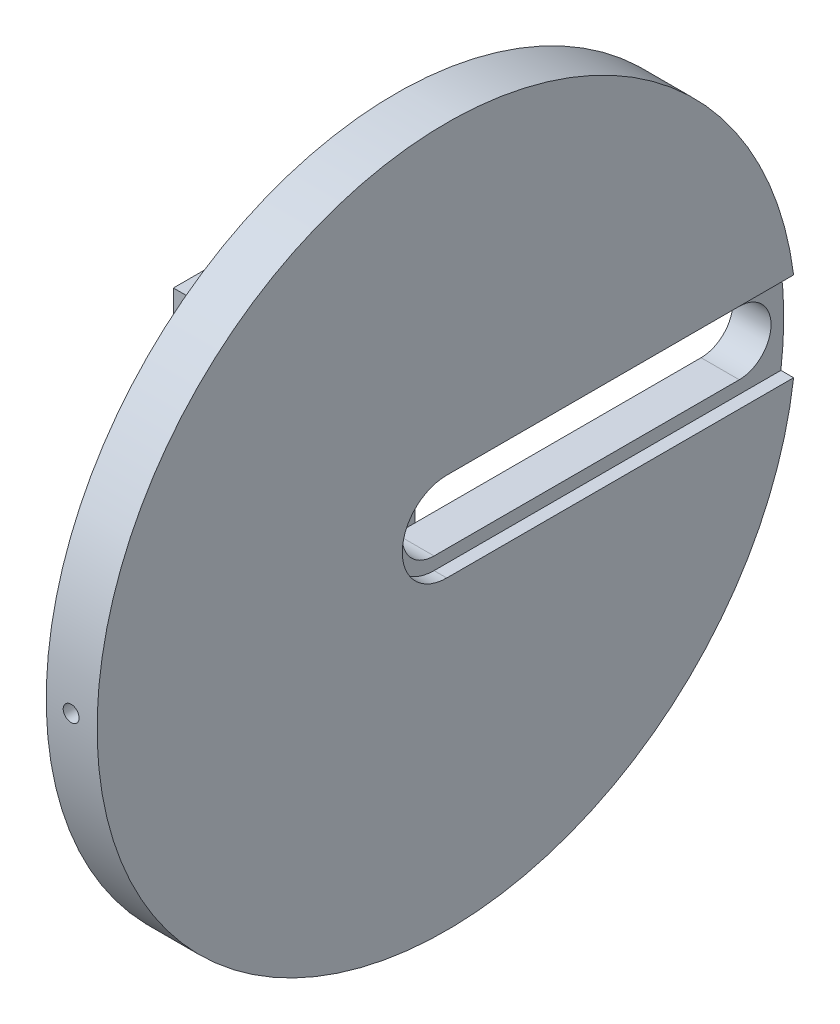
ISO-10303-21;
HEADER;
FILE_DESCRIPTION(('STEP AP214'),'2;1');
FILE_NAME('part.step','',(''),(''),'','','');
FILE_SCHEMA(('AUTOMOTIVE_DESIGN { 1 0 10303 214 1 1 1 1 }'));
ENDSEC;
DATA;
#1=APPLICATION_CONTEXT('core data for automotive mechanical design processes');
#2=APPLICATION_PROTOCOL_DEFINITION('international standard','automotive_design',2000,#1);
#3=PRODUCT_CONTEXT('',#1,'mechanical');
#4=PRODUCT('Part','Part','',(#3));
#5=PRODUCT_RELATED_PRODUCT_CATEGORY('part','',(#4));
#6=PRODUCT_DEFINITION_FORMATION('','',#4);
#7=PRODUCT_DEFINITION_CONTEXT('part definition',#1,'design');
#8=PRODUCT_DEFINITION('design','',#6,#7);
#9=PRODUCT_DEFINITION_SHAPE('','',#8);
#10=(LENGTH_UNIT() NAMED_UNIT(*) SI_UNIT(.MILLI.,.METRE.));
#11=(NAMED_UNIT(*) PLANE_ANGLE_UNIT() SI_UNIT($,.RADIAN.));
#12=(NAMED_UNIT(*) SI_UNIT($,.STERADIAN.) SOLID_ANGLE_UNIT());
#13=UNCERTAINTY_MEASURE_WITH_UNIT(LENGTH_MEASURE(1.E-05),#10,'distance_accuracy_value','');
#14=(GEOMETRIC_REPRESENTATION_CONTEXT(3) GLOBAL_UNCERTAINTY_ASSIGNED_CONTEXT((#13)) GLOBAL_UNIT_ASSIGNED_CONTEXT((#10,
#11,#12)) REPRESENTATION_CONTEXT('',''));
#15=CARTESIAN_POINT('',(0.,0.,0.));
#16=DIRECTION('',(0.,0.,1.));
#17=DIRECTION('',(1.,0.,0.));
#18=AXIS2_PLACEMENT_3D('',#15,#16,#17);
#19=CARTESIAN_POINT('',(-0.001000000000001,0.,0.));
#20=DIRECTION('',(1.,0.,0.));
#21=DIRECTION('',(0.,0.,-1.));
#22=AXIS2_PLACEMENT_3D('',#19,#20,#21);
#23=CYLINDRICAL_SURFACE('',#22,5.);
#24=CARTESIAN_POINT('',(36.,0.,0.));
#25=DIRECTION('',(1.,0.,0.));
#26=DIRECTION('',(0.,0.,-1.));
#27=AXIS2_PLACEMENT_3D('',#24,#25,#26);
#28=CIRCLE('',#27,5.);
#29=CARTESIAN_POINT('',(36.,-5.,0.));
#30=VERTEX_POINT('',#29);
#31=CARTESIAN_POINT('',(36.,5.,0.));
#32=VERTEX_POINT('',#31);
#33=EDGE_CURVE('E204',#30,#32,#28,.F.);
#34=ORIENTED_EDGE('',*,*,#33,.F.);
#35=DIRECTION('',(1.,0.,0.));
#36=VECTOR('',#35,1.);
#37=CARTESIAN_POINT('',(-0.001000000000001,-5.,0.));
#38=LINE('',#37,#36);
#39=CARTESIAN_POINT('',(30.,-5.,0.));
#40=VERTEX_POINT('',#39);
#41=EDGE_CURVE('E214',#40,#30,#38,.T.);
#42=ORIENTED_EDGE('',*,*,#41,.F.);
#43=CARTESIAN_POINT('',(30.,0.,0.));
#44=DIRECTION('',(1.,0.,0.));
#45=DIRECTION('',(0.,0.,-1.));
#46=AXIS2_PLACEMENT_3D('',#43,#44,#45);
#47=CIRCLE('',#46,5.);
#48=CARTESIAN_POINT('',(30.,5.,0.));
#49=VERTEX_POINT('',#48);
#50=EDGE_CURVE('E211',#40,#49,#47,.F.);
#51=ORIENTED_EDGE('',*,*,#50,.T.);
#52=DIRECTION('',(1.,0.,0.));
#53=VECTOR('',#52,1.);
#54=CARTESIAN_POINT('',(-0.001000000000001,5.,0.));
#55=LINE('',#54,#53);
#56=EDGE_CURVE('E215',#49,#32,#55,.T.);
#57=ORIENTED_EDGE('',*,*,#56,.T.);
#58=EDGE_LOOP('',(#34,#42,#51,#57));
#59=FACE_BOUND('',#58,.T.);
#60=ADVANCED_FACE('F39',(#59),#23,.F.);
#61=CARTESIAN_POINT('',(-0.001000000000001,5.,0.));
#62=DIRECTION('',(0.,-1.,0.));
#63=DIRECTION('',(0.,0.,-1.));
#64=AXIS2_PLACEMENT_3D('',#61,#62,#63);
#65=PLANE('',#64);
#66=DIRECTION('',(1.,0.,0.));
#67=VECTOR('',#66,1.);
#68=CARTESIAN_POINT('',(-0.001000000000001,5.,-48.));
#69=LINE('',#68,#67);
#70=CARTESIAN_POINT('',(30.,5.,-48.));
#71=VERTEX_POINT('',#70);
#72=CARTESIAN_POINT('',(36.,5.,-48.));
#73=VERTEX_POINT('',#72);
#74=EDGE_CURVE('E219',#71,#73,#69,.T.);
#75=ORIENTED_EDGE('',*,*,#74,.T.);
#76=DIRECTION('',(0.,0.,1.));
#77=VECTOR('',#76,1.);
#78=CARTESIAN_POINT('',(36.,5.,0.));
#79=LINE('',#78,#77);
#80=EDGE_CURVE('E201',#73,#32,#79,.T.);
#81=ORIENTED_EDGE('',*,*,#80,.T.);
#82=ORIENTED_EDGE('',*,*,#56,.F.);
#83=DIRECTION('',(0.,0.,1.));
#84=VECTOR('',#83,1.);
#85=CARTESIAN_POINT('',(30.,5.,0.));
#86=LINE('',#85,#84);
#87=EDGE_CURVE('E208',#71,#49,#86,.T.);
#88=ORIENTED_EDGE('',*,*,#87,.F.);
#89=EDGE_LOOP('',(#75,#81,#82,#88));
#90=FACE_BOUND('',#89,.T.);
#91=ADVANCED_FACE('F354',(#90),#65,.T.);
#92=CARTESIAN_POINT('',(-0.001000000000001,0.,-48.));
#93=DIRECTION('',(1.,0.,0.));
#94=DIRECTION('',(0.,0.,-1.));
#95=AXIS2_PLACEMENT_3D('',#92,#93,#94);
#96=CYLINDRICAL_SURFACE('',#95,5.);
#97=CARTESIAN_POINT('',(36.,0.,-48.));
#98=DIRECTION('',(1.,0.,0.));
#99=DIRECTION('',(0.,0.,-1.));
#100=AXIS2_PLACEMENT_3D('',#97,#98,#99);
#101=CIRCLE('',#100,5.);
#102=CARTESIAN_POINT('',(36.,-5.,-48.));
#103=VERTEX_POINT('',#102);
#104=EDGE_CURVE('E66',#73,#103,#101,.F.);
#105=ORIENTED_EDGE('',*,*,#104,.F.);
#106=ORIENTED_EDGE('',*,*,#74,.F.);
#107=CARTESIAN_POINT('',(30.,0.,-48.));
#108=DIRECTION('',(1.,0.,0.));
#109=DIRECTION('',(0.,0.,-1.));
#110=AXIS2_PLACEMENT_3D('',#107,#108,#109);
#111=CIRCLE('',#110,5.);
#112=CARTESIAN_POINT('',(30.,-5.,-48.));
#113=VERTEX_POINT('',#112);
#114=EDGE_CURVE('E206',#71,#113,#111,.F.);
#115=ORIENTED_EDGE('',*,*,#114,.T.);
#116=DIRECTION('',(1.,0.,0.));
#117=VECTOR('',#116,1.);
#118=CARTESIAN_POINT('',(-0.001000000000001,-5.,-48.));
#119=LINE('',#118,#117);
#120=EDGE_CURVE('E222',#113,#103,#119,.T.);
#121=ORIENTED_EDGE('',*,*,#120,.T.);
#122=EDGE_LOOP('',(#105,#106,#115,#121));
#123=FACE_BOUND('',#122,.T.);
#124=ADVANCED_FACE('F360',(#123),#96,.F.);
#125=CARTESIAN_POINT('',(-0.001000000000001,-5.,0.));
#126=DIRECTION('',(0.,-1.,0.));
#127=DIRECTION('',(0.,0.,-1.));
#128=AXIS2_PLACEMENT_3D('',#125,#126,#127);
#129=PLANE('',#128);
#130=DIRECTION('',(0.,0.,1.));
#131=VECTOR('',#130,1.);
#132=CARTESIAN_POINT('',(36.,-5.,0.));
#133=LINE('',#132,#131);
#134=EDGE_CURVE('E51',#103,#30,#133,.T.);
#135=ORIENTED_EDGE('',*,*,#134,.F.);
#136=ORIENTED_EDGE('',*,*,#120,.F.);
#137=DIRECTION('',(0.,0.,1.));
#138=VECTOR('',#137,1.);
#139=CARTESIAN_POINT('',(30.,-5.,0.));
#140=LINE('',#139,#138);
#141=EDGE_CURVE('E218',#113,#40,#140,.T.);
#142=ORIENTED_EDGE('',*,*,#141,.T.);
#143=ORIENTED_EDGE('',*,*,#41,.T.);
#144=EDGE_LOOP('',(#135,#136,#142,#143));
#145=FACE_BOUND('',#144,.T.);
#146=ADVANCED_FACE('F365',(#145),#129,.F.);
#147=CARTESIAN_POINT('',(18.,0.,0.));
#148=DIRECTION('',(-1.,0.,0.));
#149=DIRECTION('',(0.,0.,1.));
#150=AXIS2_PLACEMENT_3D('',#147,#148,#149);
#151=PLANE('',#150);
#152=CARTESIAN_POINT('',(18.,0.,0.));
#153=DIRECTION('',(-1.,0.,0.));
#154=DIRECTION('',(0.,0.,1.));
#155=AXIS2_PLACEMENT_3D('',#152,#153,#154);
#156=CIRCLE('',#155,9.);
#157=CARTESIAN_POINT('',(18.,0.,9.));
#158=VERTEX_POINT('',#157);
#159=EDGE_CURVE('E169',#158,#158,#156,.F.);
#160=ORIENTED_EDGE('',*,*,#159,.F.);
#161=EDGE_LOOP('',(#160));
#162=FACE_BOUND('',#161,.T.);
#163=DIRECTION('',(0.,0.,1.));
#164=VECTOR('',#163,1.);
#165=CARTESIAN_POINT('',(18.,-18.,15.));
#166=LINE('',#165,#164);
#167=CARTESIAN_POINT('',(18.,-18.,-15.));
#168=VERTEX_POINT('',#167);
#169=CARTESIAN_POINT('',(18.,-18.,15.));
#170=VERTEX_POINT('',#169);
#171=EDGE_CURVE('E233',#168,#170,#166,.T.);
#172=ORIENTED_EDGE('',*,*,#171,.F.);
#173=DIRECTION('',(0.,1.,0.));
#174=VECTOR('',#173,1.);
#175=CARTESIAN_POINT('',(18.,-26.,-15.));
#176=LINE('',#175,#174);
#177=CARTESIAN_POINT('',(18.,18.,-15.));
#178=VERTEX_POINT('',#177);
#179=EDGE_CURVE('E290',#168,#178,#176,.T.);
#180=ORIENTED_EDGE('',*,*,#179,.T.);
#181=DIRECTION('',(0.,0.,-1.));
#182=VECTOR('',#181,1.);
#183=CARTESIAN_POINT('',(18.,18.,15.));
#184=LINE('',#183,#182);
#185=CARTESIAN_POINT('',(18.,18.,15.));
#186=VERTEX_POINT('',#185);
#187=EDGE_CURVE('E256',#186,#178,#184,.T.);
#188=ORIENTED_EDGE('',*,*,#187,.F.);
#189=DIRECTION('',(0.,-1.,0.));
#190=VECTOR('',#189,1.);
#191=CARTESIAN_POINT('',(18.,-26.,15.));
#192=LINE('',#191,#190);
#193=EDGE_CURVE('E278',#186,#170,#192,.T.);
#194=ORIENTED_EDGE('',*,*,#193,.T.);
#195=EDGE_LOOP('',(#172,#180,#188,#194));
#196=FACE_BOUND('',#195,.T.);
#197=ADVANCED_FACE('F334',(#162,#196),#151,.F.);
#198=CARTESIAN_POINT('',(10.,0.,0.));
#199=DIRECTION('',(-1.,0.,0.));
#200=DIRECTION('',(0.,0.,1.));
#201=AXIS2_PLACEMENT_3D('',#198,#199,#200);
#202=PLANE('',#201);
#203=CARTESIAN_POINT('',(10.,0.,0.));
#204=DIRECTION('',(-1.,0.,0.));
#205=DIRECTION('',(0.,0.,1.));
#206=AXIS2_PLACEMENT_3D('',#203,#204,#205);
#207=CIRCLE('',#206,9.);
#208=CARTESIAN_POINT('',(10.,0.,9.));
#209=VERTEX_POINT('',#208);
#210=EDGE_CURVE('E166',#209,#209,#207,.F.);
#211=ORIENTED_EDGE('',*,*,#210,.T.);
#212=EDGE_LOOP('',(#211));
#213=FACE_BOUND('',#212,.T.);
#214=DIRECTION('',(0.,1.,0.));
#215=VECTOR('',#214,1.);
#216=CARTESIAN_POINT('',(10.,-26.,-15.));
#217=LINE('',#216,#215);
#218=CARTESIAN_POINT('',(10.,-26.,-15.));
#219=VERTEX_POINT('',#218);
#220=CARTESIAN_POINT('',(10.,26.,-15.));
#221=VERTEX_POINT('',#220);
#222=EDGE_CURVE('E287',#219,#221,#217,.T.);
#223=ORIENTED_EDGE('',*,*,#222,.F.);
#224=DIRECTION('',(0.,0.,-1.));
#225=VECTOR('',#224,1.);
#226=CARTESIAN_POINT('',(10.,-26.,15.));
#227=LINE('',#226,#225);
#228=CARTESIAN_POINT('',(10.,-26.,15.));
#229=VERTEX_POINT('',#228);
#230=EDGE_CURVE('E291',#229,#219,#227,.T.);
#231=ORIENTED_EDGE('',*,*,#230,.F.);
#232=DIRECTION('',(0.,-1.,0.));
#233=VECTOR('',#232,1.);
#234=CARTESIAN_POINT('',(10.,-26.,15.));
#235=LINE('',#234,#233);
#236=CARTESIAN_POINT('',(10.,26.,15.));
#237=VERTEX_POINT('',#236);
#238=EDGE_CURVE('E309',#237,#229,#235,.T.);
#239=ORIENTED_EDGE('',*,*,#238,.F.);
#240=DIRECTION('',(0.,0.,1.));
#241=VECTOR('',#240,1.);
#242=CARTESIAN_POINT('',(10.,26.,15.));
#243=LINE('',#242,#241);
#244=EDGE_CURVE('E311',#221,#237,#243,.T.);
#245=ORIENTED_EDGE('',*,*,#244,.F.);
#246=EDGE_LOOP('',(#223,#231,#239,#245));
#247=FACE_BOUND('',#246,.T.);
#248=ADVANCED_FACE('F319',(#213,#247),#202,.T.);
#249=CARTESIAN_POINT('',(18.,-26.,-15.));
#250=DIRECTION('',(0.,0.,1.));
#251=DIRECTION('',(1.,0.,0.));
#252=AXIS2_PLACEMENT_3D('',#249,#250,#251);
#253=PLANE('',#252);
#254=ORIENTED_EDGE('',*,*,#222,.T.);
#255=DIRECTION('',(-1.,0.,0.));
#256=VECTOR('',#255,1.);
#257=CARTESIAN_POINT('',(18.,26.,-15.));
#258=LINE('',#257,#256);
#259=CARTESIAN_POINT('',(30.,26.,-15.));
#260=VERTEX_POINT('',#259);
#261=EDGE_CURVE('E292',#260,#221,#258,.T.);
#262=ORIENTED_EDGE('',*,*,#261,.F.);
#263=DIRECTION('',(0.,1.,0.));
#264=VECTOR('',#263,1.);
#265=CARTESIAN_POINT('',(30.,26.,-15.));
#266=LINE('',#265,#264);
#267=CARTESIAN_POINT('',(30.,18.,-15.));
#268=VERTEX_POINT('',#267);
#269=EDGE_CURVE('E263',#268,#260,#266,.T.);
#270=ORIENTED_EDGE('',*,*,#269,.F.);
#271=DIRECTION('',(-1.,0.,0.));
#272=VECTOR('',#271,1.);
#273=CARTESIAN_POINT('',(30.,18.,-15.));
#274=LINE('',#273,#272);
#275=EDGE_CURVE('E269',#268,#178,#274,.T.);
#276=ORIENTED_EDGE('',*,*,#275,.T.);
#277=ORIENTED_EDGE('',*,*,#179,.F.);
#278=DIRECTION('',(-1.,0.,0.));
#279=VECTOR('',#278,1.);
#280=CARTESIAN_POINT('',(30.,-18.,-15.));
#281=LINE('',#280,#279);
#282=CARTESIAN_POINT('',(30.,-18.,-15.));
#283=VERTEX_POINT('',#282);
#284=EDGE_CURVE('E253',#283,#168,#281,.T.);
#285=ORIENTED_EDGE('',*,*,#284,.F.);
#286=DIRECTION('',(0.,1.,0.));
#287=VECTOR('',#286,1.);
#288=CARTESIAN_POINT('',(30.,-26.,-15.));
#289=LINE('',#288,#287);
#290=CARTESIAN_POINT('',(30.,-26.,-15.));
#291=VERTEX_POINT('',#290);
#292=EDGE_CURVE('E242',#291,#283,#289,.T.);
#293=ORIENTED_EDGE('',*,*,#292,.F.);
#294=DIRECTION('',(-1.,0.,0.));
#295=VECTOR('',#294,1.);
#296=CARTESIAN_POINT('',(18.,-26.,-15.));
#297=LINE('',#296,#295);
#298=EDGE_CURVE('E305',#291,#219,#297,.T.);
#299=ORIENTED_EDGE('',*,*,#298,.T.);
#300=EDGE_LOOP('',(#254,#262,#270,#276,#277,#285,#293,#299));
#301=FACE_BOUND('',#300,.T.);
#302=ADVANCED_FACE('F41',(#301),#253,.F.);
#303=CARTESIAN_POINT('',(18.,26.,15.));
#304=DIRECTION('',(0.,-1.,0.));
#305=DIRECTION('',(0.,0.,-1.));
#306=AXIS2_PLACEMENT_3D('',#303,#304,#305);
#307=PLANE('',#306);
#308=ORIENTED_EDGE('',*,*,#244,.T.);
#309=DIRECTION('',(-1.,0.,0.));
#310=VECTOR('',#309,1.);
#311=CARTESIAN_POINT('',(18.,26.,15.));
#312=LINE('',#311,#310);
#313=CARTESIAN_POINT('',(30.,26.,15.));
#314=VERTEX_POINT('',#313);
#315=EDGE_CURVE('E295',#314,#237,#312,.T.);
#316=ORIENTED_EDGE('',*,*,#315,.F.);
#317=DIRECTION('',(0.,0.,1.));
#318=VECTOR('',#317,1.);
#319=CARTESIAN_POINT('',(30.,26.,15.));
#320=LINE('',#319,#318);
#321=EDGE_CURVE('E266',#260,#314,#320,.T.);
#322=ORIENTED_EDGE('',*,*,#321,.F.);
#323=ORIENTED_EDGE('',*,*,#261,.T.);
#324=EDGE_LOOP('',(#308,#316,#322,#323));
#325=FACE_BOUND('',#324,.T.);
#326=ADVANCED_FACE('F321',(#325),#307,.F.);
#327=CARTESIAN_POINT('',(18.,-26.,15.));
#328=DIRECTION('',(0.,0.,-1.));
#329=DIRECTION('',(-1.,0.,0.));
#330=AXIS2_PLACEMENT_3D('',#327,#328,#329);
#331=PLANE('',#330);
#332=ORIENTED_EDGE('',*,*,#238,.T.);
#333=DIRECTION('',(-1.,0.,0.));
#334=VECTOR('',#333,1.);
#335=CARTESIAN_POINT('',(18.,-26.,15.));
#336=LINE('',#335,#334);
#337=CARTESIAN_POINT('',(30.,-26.,15.));
#338=VERTEX_POINT('',#337);
#339=EDGE_CURVE('E300',#338,#229,#336,.T.);
#340=ORIENTED_EDGE('',*,*,#339,.F.);
#341=DIRECTION('',(0.,-1.,0.));
#342=VECTOR('',#341,1.);
#343=CARTESIAN_POINT('',(30.,-26.,15.));
#344=LINE('',#343,#342);
#345=CARTESIAN_POINT('',(30.,-18.,15.));
#346=VERTEX_POINT('',#345);
#347=EDGE_CURVE('E236',#346,#338,#344,.T.);
#348=ORIENTED_EDGE('',*,*,#347,.F.);
#349=DIRECTION('',(-1.,0.,0.));
#350=VECTOR('',#349,1.);
#351=CARTESIAN_POINT('',(30.,-18.,15.));
#352=LINE('',#351,#350);
#353=EDGE_CURVE('E248',#346,#170,#352,.T.);
#354=ORIENTED_EDGE('',*,*,#353,.T.);
#355=ORIENTED_EDGE('',*,*,#193,.F.);
#356=DIRECTION('',(-1.,0.,0.));
#357=VECTOR('',#356,1.);
#358=CARTESIAN_POINT('',(30.,18.,15.));
#359=LINE('',#358,#357);
#360=CARTESIAN_POINT('',(30.,18.,15.));
#361=VERTEX_POINT('',#360);
#362=EDGE_CURVE('E282',#361,#186,#359,.T.);
#363=ORIENTED_EDGE('',*,*,#362,.F.);
#364=DIRECTION('',(0.,-1.,0.));
#365=VECTOR('',#364,1.);
#366=CARTESIAN_POINT('',(30.,26.,15.));
#367=LINE('',#366,#365);
#368=EDGE_CURVE('E257',#314,#361,#367,.T.);
#369=ORIENTED_EDGE('',*,*,#368,.F.);
#370=ORIENTED_EDGE('',*,*,#315,.T.);
#371=EDGE_LOOP('',(#332,#340,#348,#354,#355,#363,#369,#370));
#372=FACE_BOUND('',#371,.T.);
#373=ADVANCED_FACE('F324',(#372),#331,.F.);
#374=CARTESIAN_POINT('',(18.,-26.,15.));
#375=DIRECTION('',(0.,1.,0.));
#376=DIRECTION('',(0.,0.,1.));
#377=AXIS2_PLACEMENT_3D('',#374,#375,#376);
#378=PLANE('',#377);
#379=ORIENTED_EDGE('',*,*,#230,.T.);
#380=ORIENTED_EDGE('',*,*,#298,.F.);
#381=DIRECTION('',(0.,0.,-1.));
#382=VECTOR('',#381,1.);
#383=CARTESIAN_POINT('',(30.,-26.,15.));
#384=LINE('',#383,#382);
#385=EDGE_CURVE('E239',#338,#291,#384,.T.);
#386=ORIENTED_EDGE('',*,*,#385,.F.);
#387=ORIENTED_EDGE('',*,*,#339,.T.);
#388=EDGE_LOOP('',(#379,#380,#386,#387));
#389=FACE_BOUND('',#388,.T.);
#390=ADVANCED_FACE('F343',(#389),#378,.F.);
#391=CARTESIAN_POINT('',(30.,18.,15.));
#392=DIRECTION('',(0.,1.,0.));
#393=DIRECTION('',(0.,0.,1.));
#394=AXIS2_PLACEMENT_3D('',#391,#392,#393);
#395=PLANE('',#394);
#396=ORIENTED_EDGE('',*,*,#187,.T.);
#397=ORIENTED_EDGE('',*,*,#275,.F.);
#398=DIRECTION('',(0.,0.,-1.));
#399=VECTOR('',#398,1.);
#400=CARTESIAN_POINT('',(30.,18.,15.));
#401=LINE('',#400,#399);
#402=EDGE_CURVE('E260',#361,#268,#401,.T.);
#403=ORIENTED_EDGE('',*,*,#402,.F.);
#404=ORIENTED_EDGE('',*,*,#362,.T.);
#405=EDGE_LOOP('',(#396,#397,#403,#404));
#406=FACE_BOUND('',#405,.T.);
#407=ADVANCED_FACE('F332',(#406),#395,.F.);
#408=CARTESIAN_POINT('',(30.,-18.,15.));
#409=DIRECTION('',(0.,-1.,0.));
#410=DIRECTION('',(0.,0.,-1.));
#411=AXIS2_PLACEMENT_3D('',#408,#409,#410);
#412=PLANE('',#411);
#413=ORIENTED_EDGE('',*,*,#171,.T.);
#414=ORIENTED_EDGE('',*,*,#353,.F.);
#415=DIRECTION('',(0.,0.,1.));
#416=VECTOR('',#415,1.);
#417=CARTESIAN_POINT('',(30.,-18.,15.));
#418=LINE('',#417,#416);
#419=EDGE_CURVE('E245',#283,#346,#418,.T.);
#420=ORIENTED_EDGE('',*,*,#419,.F.);
#421=ORIENTED_EDGE('',*,*,#284,.T.);
#422=EDGE_LOOP('',(#413,#414,#420,#421));
#423=FACE_BOUND('',#422,.T.);
#424=ADVANCED_FACE('F338',(#423),#412,.F.);
#425=CARTESIAN_POINT('',(30.,0.,0.));
#426=DIRECTION('',(1.,0.,0.));
#427=DIRECTION('',(0.,0.,-1.));
#428=AXIS2_PLACEMENT_3D('',#425,#426,#427);
#429=PLANE('',#428);
#430=ORIENTED_EDGE('',*,*,#87,.T.);
#431=ORIENTED_EDGE('',*,*,#50,.F.);
#432=ORIENTED_EDGE('',*,*,#141,.F.);
#433=ORIENTED_EDGE('',*,*,#114,.F.);
#434=EDGE_LOOP('',(#430,#431,#432,#433));
#435=FACE_BOUND('',#434,.T.);
#436=ORIENTED_EDGE('',*,*,#347,.T.);
#437=ORIENTED_EDGE('',*,*,#385,.T.);
#438=ORIENTED_EDGE('',*,*,#292,.T.);
#439=ORIENTED_EDGE('',*,*,#419,.T.);
#440=EDGE_LOOP('',(#436,#437,#438,#439));
#441=FACE_BOUND('',#440,.T.);
#442=CARTESIAN_POINT('',(30.,0.,0.));
#443=DIRECTION('',(1.,0.,0.));
#444=DIRECTION('',(0.,0.,-1.));
#445=AXIS2_PLACEMENT_3D('',#442,#443,#444);
#446=CIRCLE('',#445,55.);
#447=CARTESIAN_POINT('',(30.,0.,-55.));
#448=VERTEX_POINT('',#447);
#449=EDGE_CURVE('E229',#448,#448,#446,.T.);
#450=ORIENTED_EDGE('',*,*,#449,.F.);
#451=EDGE_LOOP('',(#450));
#452=FACE_BOUND('',#451,.T.);
#453=ORIENTED_EDGE('',*,*,#402,.T.);
#454=ORIENTED_EDGE('',*,*,#269,.T.);
#455=ORIENTED_EDGE('',*,*,#321,.T.);
#456=ORIENTED_EDGE('',*,*,#368,.T.);
#457=EDGE_LOOP('',(#453,#454,#455,#456));
#458=FACE_BOUND('',#457,.T.);
#459=ADVANCED_FACE('F328',(#435,#441,#452,#458),#429,.F.);
#460=CARTESIAN_POINT('',(38.,0.,0.));
#461=DIRECTION('',(-1.,0.,0.));
#462=DIRECTION('',(0.,0.,1.));
#463=AXIS2_PLACEMENT_3D('',#460,#461,#462);
#464=CYLINDRICAL_SURFACE('',#463,55.);
#465=CARTESIAN_POINT('',(35.1687185731574,0.,55.));
#466=CARTESIAN_POINT('',(35.1687154629174,-0.0702033225971107,54.9999998083149));
#467=CARTESIAN_POINT('',(35.1627845165973,-0.140457318451282,54.9998641436759));
#468=CARTESIAN_POINT('',(35.1392074714067,-0.279029811415266,54.9993359924255));
#469=CARTESIAN_POINT('',(35.1215473330444,-0.347345886586122,54.9989431980455));
#470=CARTESIAN_POINT('',(35.0750155055497,-0.480014960528598,54.9979452762615));
#471=CARTESIAN_POINT('',(35.0461492458831,-0.544369861057251,54.9973402516985));
#472=CARTESIAN_POINT('',(34.9780322309823,-0.667302220283155,54.9959861402455));
#473=CARTESIAN_POINT('',(34.9387840308411,-0.725881095651578,54.9952370888142));
#474=CARTESIAN_POINT('',(34.8510018233051,-0.83563564240584,54.9936790140363));
#475=CARTESIAN_POINT('',(34.8024653495349,-0.886809341094589,54.9928699747958));
#476=CARTESIAN_POINT('',(34.697488162228,-0.980284479427353,54.9912832504395));
#477=CARTESIAN_POINT('',(34.641047135922,-1.02258556783222,54.990505566566));
#478=CARTESIAN_POINT('',(34.5218580588459,-1.0971159329841,54.9890691986985));
#479=CARTESIAN_POINT('',(34.4591094432909,-1.1293443067511,54.9884105253755));
#480=CARTESIAN_POINT('',(34.3290904760957,-1.18280840216345,54.9872865620097));
#481=CARTESIAN_POINT('',(34.261820138736,-1.20404415852373,54.9868212713564));
#482=CARTESIAN_POINT('',(34.1246795870205,-1.23491674399312,54.9861366306439));
#483=CARTESIAN_POINT('',(34.0548098249757,-1.24455558137512,54.9859172380023));
#484=CARTESIAN_POINT('',(33.9144436059398,-1.25196689341139,54.9857490017193));
#485=CARTESIAN_POINT('',(33.843947150866,-1.24973940435953,54.9858001572504));
#486=CARTESIAN_POINT('',(33.7043423167665,-1.23348302226206,54.9861672088946));
#487=CARTESIAN_POINT('',(33.6352336839087,-1.21945630779407,54.9864830561357));
#488=CARTESIAN_POINT('',(33.5003523387652,-1.18000300635237,54.9873438073805));
#489=CARTESIAN_POINT('',(33.4345796321968,-1.15457639984145,54.9878887117767));
#490=CARTESIAN_POINT('',(33.3082302325844,-1.09304258801365,54.9891462040845));
#491=CARTESIAN_POINT('',(33.2476540263589,-1.05693438342978,54.9898588076831));
#492=CARTESIAN_POINT('',(33.1334225346168,-0.975063117914926,54.9913713461912));
#493=CARTESIAN_POINT('',(33.0797672569849,-0.929300045984877,54.9921712812001));
#494=CARTESIAN_POINT('',(32.9808879965023,-0.829405758170149,54.993768519721));
#495=CARTESIAN_POINT('',(32.9356659246492,-0.775272650673601,54.9945658225964));
#496=CARTESIAN_POINT('',(32.8549514884159,-0.660181625707142,54.996067737825));
#497=CARTESIAN_POINT('',(32.8194591254693,-0.599223707231658,54.9967723501645));
#498=CARTESIAN_POINT('',(32.7592118425164,-0.472212409220082,54.9980094562844));
#499=CARTESIAN_POINT('',(32.7344569808221,-0.406159002014322,54.9985419491299));
#500=CARTESIAN_POINT('',(32.6963886215412,-0.270832239126326,54.9993747714152));
#501=CARTESIAN_POINT('',(32.6830751058633,-0.201558888535736,54.999675101222));
#502=CARTESIAN_POINT('',(32.6682697023611,-0.0617752845858374,55.0000096942994));
#503=CARTESIAN_POINT('',(32.6667751707788,0.0087346886197038,55.0000440170724));
#504=CARTESIAN_POINT('',(32.6756432731366,0.149004573067808,54.9998428843483));
#505=CARTESIAN_POINT('',(32.6860058994228,0.218764484794512,54.9996074290253));
#506=CARTESIAN_POINT('',(32.7182919695658,0.3555466305284,54.9988933186772));
#507=CARTESIAN_POINT('',(32.7402142148637,0.422569147586204,54.9984146888658));
#508=CARTESIAN_POINT('',(32.7949960051069,0.551982636371895,54.9972681756064));
#509=CARTESIAN_POINT('',(32.8278555620766,0.61437360300779,54.9966002919503));
#510=CARTESIAN_POINT('',(32.9035860171131,0.732765094902012,54.9951503865922));
#511=CARTESIAN_POINT('',(32.9464586955816,0.788764481054191,54.9943683446013));
#512=CARTESIAN_POINT('',(33.040995772815,0.892771748529622,54.9927783404182));
#513=CARTESIAN_POINT('',(33.0926601859742,0.940779616768441,54.9919703781835));
#514=CARTESIAN_POINT('',(33.2033254731257,1.02744987003503,54.9904194516864));
#515=CARTESIAN_POINT('',(33.2623276833995,1.06611054906708,54.9896764993051));
#516=CARTESIAN_POINT('',(33.3859868285842,1.13297729831911,54.9883395431988));
#517=CARTESIAN_POINT('',(33.4506437536333,1.16118338677133,54.987745539214));
#518=CARTESIAN_POINT('',(33.5837705054313,1.20633730851337,54.9867735356912));
#519=CARTESIAN_POINT('',(33.6522399559727,1.22328625049517,54.9863955148819));
#520=CARTESIAN_POINT('',(33.791053538087,1.24544840138361,54.9858980377502));
#521=CARTESIAN_POINT('',(33.861397670155,1.25066160719106,54.985778581496));
#522=CARTESIAN_POINT('',(34.0019466025633,1.24920415341509,54.9858117097198));
#523=CARTESIAN_POINT('',(34.0721514309195,1.24253619255843,54.9859642324196));
#524=CARTESIAN_POINT('',(34.2104449584081,1.21751121518807,54.9865239942186));
#525=CARTESIAN_POINT('',(34.2785336533169,1.19915417534568,54.9869312338261));
#526=CARTESIAN_POINT('',(34.4106636179346,1.15127231564921,54.9879545142859));
#527=CARTESIAN_POINT('',(34.4747048155149,1.12174729684142,54.988570558858));
#528=CARTESIAN_POINT('',(34.5969195440842,1.05236905758342,54.9899419701183));
#529=CARTESIAN_POINT('',(34.6550932948987,1.01251622426765,54.9906973315839));
#530=CARTESIAN_POINT('',(34.7639329116408,0.923607750252819,54.9922623665165));
#531=CARTESIAN_POINT('',(34.8145978702575,0.874550999035809,54.9930720465299));
#532=CARTESIAN_POINT('',(34.9069862779225,0.768613653476718,54.9946545865898));
#533=CARTESIAN_POINT('',(34.9487075062762,0.711731121765585,54.9954274374548));
#534=CARTESIAN_POINT('',(35.0220283078762,0.591739935831391,54.9968493968781));
#535=CARTESIAN_POINT('',(35.0536220454015,0.528627719198091,54.9974984340048));
#536=CARTESIAN_POINT('',(35.1057286356425,0.398042425524083,54.9985982353141));
#537=CARTESIAN_POINT('',(35.1262547319824,0.330574669140861,54.9990492363476));
#538=CARTESIAN_POINT('',(35.1501905336646,0.218899253610479,54.9995813132123));
#539=CARTESIAN_POINT('',(35.1571298363876,0.175416795376113,54.9997376415951));
#540=CARTESIAN_POINT('',(35.1663948302298,0.0879628572080044,54.9999470450379));
#541=CARTESIAN_POINT('',(35.1687205221212,0.0439913773561107,55.0000001201153));
#542=CARTESIAN_POINT('',(35.1687185731574,0.,55.));
#543=B_SPLINE_CURVE_WITH_KNOTS('',3,(#465,#466,#467,#468,#469,#470,#471,#472,#473,#474,#475,
#476,#477,#478,#479,#480,#481,#482,#483,#484,#485,#486,#487,#488,#489,#490,#491,#492,#493,#494,
#495,#496,#497,#498,#499,#500,#501,#502,#503,#504,#505,#506,#507,#508,#509,#510,#511,#512,#513,
#514,#515,#516,#517,#518,#519,#520,#521,#522,#523,#524,#525,#526,#527,#528,#529,#530,#531,#532,
#533,#534,#535,#536,#537,#538,#539,#540,#541,#542),.UNSPECIFIED.,.T.,.F.,(4,2,2,2,2,2,2,2,2,2,2,
2,2,2,2,2,2,2,2,2,2,2,2,2,2,2,2,2,2,2,2,2,2,2,2,2,2,2,4),(0.,0.210449396042927,
0.421151148793427,0.631750941819516,0.842298952404381,1.05290294893607,1.26351528105457,
1.47414648834425,1.68477703045177,1.89537109179027,2.10596450901471,2.3165190513629,
2.52707395456209,2.73764856147367,2.9482234082783,3.15884591433847,3.36946845143195,
3.58009213233451,3.79071548019247,4.00129171292608,4.21186780973095,4.4224220772475,
4.63297657624699,4.84356854182449,5.05416085219875,5.26479156971582,5.47542191990269,
5.68603152248496,5.89664118068548,6.1072030064229,6.31776525239421,6.52833124963592,
6.73888935502745,6.9494728821044,7.16010863587092,7.37086554610728,7.5813697001583,
7.7132432355225,7.84511674881503),.UNSPECIFIED.);
#544=CARTESIAN_POINT('',(35.1687185731574,0.,55.));
#545=VERTEX_POINT('',#544);
#546=EDGE_CURVE('E11',#545,#545,#543,.T.);
#547=ORIENTED_EDGE('',*,*,#546,.T.);
#548=EDGE_LOOP('',(#547));
#549=FACE_BOUND('',#548,.T.);
#550=CARTESIAN_POINT('',(38.,0.,0.));
#551=DIRECTION('',(1.,0.,0.));
#552=DIRECTION('',(0.,0.,-1.));
#553=AXIS2_PLACEMENT_3D('',#550,#551,#552);
#554=CIRCLE('',#553,55.);
#555=CARTESIAN_POINT('',(38.,6.99999999999998,-54.5527267879434));
#556=VERTEX_POINT('',#555);
#557=CARTESIAN_POINT('',(38.,-7.,-54.5527267879434));
#558=VERTEX_POINT('',#557);
#559=EDGE_CURVE('E230',#556,#558,#554,.T.);
#560=ORIENTED_EDGE('',*,*,#559,.F.);
#561=DIRECTION('',(1.,0.,0.));
#562=VECTOR('',#561,1.);
#563=CARTESIAN_POINT('',(36.,6.99999999999998,-54.5527267879434));
#564=LINE('',#563,#562);
#565=CARTESIAN_POINT('',(36.,6.99999999999998,-54.5527267879434));
#566=VERTEX_POINT('',#565);
#567=EDGE_CURVE('E194',#566,#556,#564,.T.);
#568=ORIENTED_EDGE('',*,*,#567,.F.);
#569=CARTESIAN_POINT('',(36.,0.,0.));
#570=DIRECTION('',(1.,0.,0.));
#571=DIRECTION('',(0.,0.,-1.));
#572=AXIS2_PLACEMENT_3D('',#569,#570,#571);
#573=CIRCLE('',#572,55.);
#574=CARTESIAN_POINT('',(36.,-7.,-54.5527267879434));
#575=VERTEX_POINT('',#574);
#576=EDGE_CURVE('E181',#575,#566,#573,.T.);
#577=ORIENTED_EDGE('',*,*,#576,.F.);
#578=DIRECTION('',(1.,0.,0.));
#579=VECTOR('',#578,1.);
#580=CARTESIAN_POINT('',(36.,-7.,-54.5527267879434));
#581=LINE('',#580,#579);
#582=EDGE_CURVE('E196',#575,#558,#581,.T.);
#583=ORIENTED_EDGE('',*,*,#582,.T.);
#584=EDGE_LOOP('',(#560,#568,#577,#583));
#585=FACE_BOUND('',#584,.T.);
#586=ORIENTED_EDGE('',*,*,#449,.T.);
#587=EDGE_LOOP('',(#586));
#588=FACE_BOUND('',#587,.T.);
#589=ADVANCED_FACE('F371',(#549,#585,#588),#464,.T.);
#590=CARTESIAN_POINT('',(38.,0.,0.));
#591=DIRECTION('',(1.,0.,0.));
#592=DIRECTION('',(0.,0.,-1.));
#593=AXIS2_PLACEMENT_3D('',#590,#591,#592);
#594=PLANE('',#593);
#595=DIRECTION('',(0.,0.,1.));
#596=VECTOR('',#595,1.);
#597=CARTESIAN_POINT('',(38.,7.,0.));
#598=LINE('',#597,#596);
#599=CARTESIAN_POINT('',(38.,7.,0.));
#600=VERTEX_POINT('',#599);
#601=EDGE_CURVE('E178',#556,#600,#598,.T.);
#602=ORIENTED_EDGE('',*,*,#601,.F.);
#603=ORIENTED_EDGE('',*,*,#559,.T.);
#604=DIRECTION('',(0.,0.,-1.));
#605=VECTOR('',#604,1.);
#606=CARTESIAN_POINT('',(38.,-7.,0.));
#607=LINE('',#606,#605);
#608=CARTESIAN_POINT('',(38.,-7.,0.));
#609=VERTEX_POINT('',#608);
#610=EDGE_CURVE('E188',#609,#558,#607,.T.);
#611=ORIENTED_EDGE('',*,*,#610,.F.);
#612=CARTESIAN_POINT('',(38.,0.,0.));
#613=DIRECTION('',(1.,0.,0.));
#614=DIRECTION('',(0.,0.,-1.));
#615=AXIS2_PLACEMENT_3D('',#612,#613,#614);
#616=CIRCLE('',#615,7.);
#617=EDGE_CURVE('E58',#600,#609,#616,.T.);
#618=ORIENTED_EDGE('',*,*,#617,.F.);
#619=EDGE_LOOP('',(#602,#603,#611,#618));
#620=FACE_BOUND('',#619,.T.);
#621=ADVANCED_FACE('F367',(#620),#594,.T.);
#622=CARTESIAN_POINT('',(36.,0.,0.));
#623=DIRECTION('',(1.,0.,0.));
#624=DIRECTION('',(0.,0.,-1.));
#625=AXIS2_PLACEMENT_3D('',#622,#623,#624);
#626=PLANE('',#625);
#627=CARTESIAN_POINT('',(36.,0.,0.));
#628=DIRECTION('',(1.,0.,0.));
#629=DIRECTION('',(0.,0.,-1.));
#630=AXIS2_PLACEMENT_3D('',#627,#628,#629);
#631=CIRCLE('',#630,7.);
#632=CARTESIAN_POINT('',(36.,7.,0.));
#633=VERTEX_POINT('',#632);
#634=CARTESIAN_POINT('',(36.,-7.,0.));
#635=VERTEX_POINT('',#634);
#636=EDGE_CURVE('E174',#633,#635,#631,.T.);
#637=ORIENTED_EDGE('',*,*,#636,.T.);
#638=DIRECTION('',(0.,0.,-1.));
#639=VECTOR('',#638,1.);
#640=CARTESIAN_POINT('',(36.,-7.,0.));
#641=LINE('',#640,#639);
#642=EDGE_CURVE('E177',#635,#575,#641,.T.);
#643=ORIENTED_EDGE('',*,*,#642,.T.);
#644=ORIENTED_EDGE('',*,*,#576,.T.);
#645=DIRECTION('',(0.,0.,1.));
#646=VECTOR('',#645,1.);
#647=CARTESIAN_POINT('',(36.,7.,0.));
#648=LINE('',#647,#646);
#649=EDGE_CURVE('E183',#566,#633,#648,.T.);
#650=ORIENTED_EDGE('',*,*,#649,.T.);
#651=EDGE_LOOP('',(#637,#643,#644,#650));
#652=FACE_BOUND('',#651,.T.);
#653=ORIENTED_EDGE('',*,*,#33,.T.);
#654=ORIENTED_EDGE('',*,*,#80,.F.);
#655=ORIENTED_EDGE('',*,*,#104,.T.);
#656=ORIENTED_EDGE('',*,*,#134,.T.);
#657=EDGE_LOOP('',(#653,#654,#655,#656));
#658=FACE_BOUND('',#657,.T.);
#659=ADVANCED_FACE('F370',(#652,#658),#626,.T.);
#660=CARTESIAN_POINT('',(36.,0.,0.));
#661=DIRECTION('',(1.,0.,0.));
#662=DIRECTION('',(0.,0.,-1.));
#663=AXIS2_PLACEMENT_3D('',#660,#661,#662);
#664=CYLINDRICAL_SURFACE('',#663,7.);
#665=ORIENTED_EDGE('',*,*,#617,.T.);
#666=DIRECTION('',(1.,0.,0.));
#667=VECTOR('',#666,1.);
#668=CARTESIAN_POINT('',(36.,-7.,0.));
#669=LINE('',#668,#667);
#670=EDGE_CURVE('E186',#635,#609,#669,.T.);
#671=ORIENTED_EDGE('',*,*,#670,.F.);
#672=ORIENTED_EDGE('',*,*,#636,.F.);
#673=DIRECTION('',(1.,0.,0.));
#674=VECTOR('',#673,1.);
#675=CARTESIAN_POINT('',(36.,7.,0.));
#676=LINE('',#675,#674);
#677=EDGE_CURVE('E192',#633,#600,#676,.T.);
#678=ORIENTED_EDGE('',*,*,#677,.T.);
#679=EDGE_LOOP('',(#665,#671,#672,#678));
#680=FACE_BOUND('',#679,.T.);
#681=ADVANCED_FACE('F406',(#680),#664,.F.);
#682=CARTESIAN_POINT('',(36.,7.,0.));
#683=DIRECTION('',(0.,1.,0.));
#684=DIRECTION('',(0.,0.,1.));
#685=AXIS2_PLACEMENT_3D('',#682,#683,#684);
#686=PLANE('',#685);
#687=ORIENTED_EDGE('',*,*,#601,.T.);
#688=ORIENTED_EDGE('',*,*,#677,.F.);
#689=ORIENTED_EDGE('',*,*,#649,.F.);
#690=ORIENTED_EDGE('',*,*,#567,.T.);
#691=EDGE_LOOP('',(#687,#688,#689,#690));
#692=FACE_BOUND('',#691,.T.);
#693=ADVANCED_FACE('F400',(#692),#686,.F.);
#694=CARTESIAN_POINT('',(36.,-7.,0.));
#695=DIRECTION('',(0.,-1.,0.));
#696=DIRECTION('',(0.,0.,-1.));
#697=AXIS2_PLACEMENT_3D('',#694,#695,#696);
#698=PLANE('',#697);
#699=ORIENTED_EDGE('',*,*,#610,.T.);
#700=ORIENTED_EDGE('',*,*,#582,.F.);
#701=ORIENTED_EDGE('',*,*,#642,.F.);
#702=ORIENTED_EDGE('',*,*,#670,.T.);
#703=EDGE_LOOP('',(#699,#700,#701,#702));
#704=FACE_BOUND('',#703,.T.);
#705=ADVANCED_FACE('F393',(#704),#698,.F.);
#706=CARTESIAN_POINT('',(38.001,0.,0.));
#707=DIRECTION('',(-1.,0.,0.));
#708=DIRECTION('',(0.,0.,1.));
#709=AXIS2_PLACEMENT_3D('',#706,#707,#708);
#710=CYLINDRICAL_SURFACE('',#709,9.);
#711=ORIENTED_EDGE('',*,*,#210,.F.);
#712=EDGE_LOOP('',(#711));
#713=FACE_BOUND('',#712,.T.);
#714=ORIENTED_EDGE('',*,*,#159,.T.);
#715=EDGE_LOOP('',(#714));
#716=FACE_BOUND('',#715,.T.);
#717=ADVANCED_FACE('F390',(#713,#716),#710,.F.);
#718=CARTESIAN_POINT('',(33.9187185731574,0.,55.));
#719=DIRECTION('',(0.,0.,1.));
#720=DIRECTION('',(1.,0.,0.));
#721=AXIS2_PLACEMENT_3D('',#718,#719,#720);
#722=CYLINDRICAL_SURFACE('',#721,1.25);
#723=CARTESIAN_POINT('',(33.9187185731574,0.,50.));
#724=DIRECTION('',(0.,0.,1.));
#725=DIRECTION('',(1.,0.,0.));
#726=AXIS2_PLACEMENT_3D('',#723,#724,#725);
#727=CIRCLE('',#726,1.25);
#728=CARTESIAN_POINT('',(35.1687185731574,0.,50.));
#729=VERTEX_POINT('',#728);
#730=EDGE_CURVE('E164',#729,#729,#727,.T.);
#731=ORIENTED_EDGE('',*,*,#730,.F.);
#732=EDGE_LOOP('',(#731));
#733=FACE_BOUND('',#732,.T.);
#734=ORIENTED_EDGE('',*,*,#546,.F.);
#735=EDGE_LOOP('',(#734));
#736=FACE_BOUND('',#735,.T.);
#737=ADVANCED_FACE('F160',(#733,#736),#722,.F.);
#738=CARTESIAN_POINT('',(33.9187185731574,0.,50.));
#739=DIRECTION('',(0.,0.,1.));
#740=DIRECTION('',(1.,0.,0.));
#741=AXIS2_PLACEMENT_3D('',#738,#739,#740);
#742=CONICAL_SURFACE('',#741,1.25,1.02974425867666);
#743=CARTESIAN_POINT('',(33.9187185731574,0.,49.2489242262155));
#744=VERTEX_POINT('',#743);
#745=VERTEX_LOOP('',#744);
#746=FACE_BOUND('',#745,.T.);
#747=ORIENTED_EDGE('',*,*,#730,.T.);
#748=EDGE_LOOP('',(#747));
#749=FACE_BOUND('',#748,.T.);
#750=ADVANCED_FACE('F157',(#746,#749),#742,.F.);
#751=CLOSED_SHELL('',(#60,#91,#124,#146,#197,#248,#302,#326,#373,#390,#407,#424,#459,#589,#621,
#659,#681,#693,#705,#717,#737,#750));
#752=MANIFOLD_SOLID_BREP('B2',#751);
#753=ADVANCED_BREP_SHAPE_REPRESENTATION('',(#18,#752),#14);
#754=SHAPE_DEFINITION_REPRESENTATION(#9,#753);
ENDSEC;
END-ISO-10303-21;
